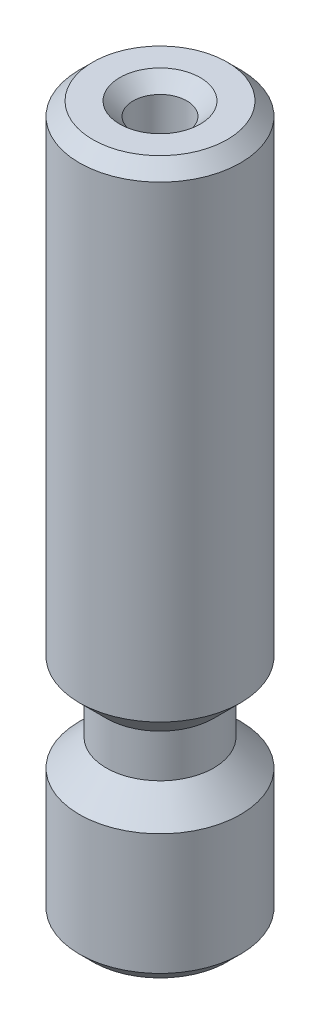
ISO-10303-21;
HEADER;
FILE_DESCRIPTION(('STEP AP214'),'2;1');
FILE_NAME('part.step','',(''),(''),'','','');
FILE_SCHEMA(('AUTOMOTIVE_DESIGN { 1 0 10303 214 1 1 1 1 }'));
ENDSEC;
DATA;
#1=APPLICATION_CONTEXT('core data for automotive mechanical design processes');
#2=APPLICATION_PROTOCOL_DEFINITION('international standard','automotive_design',2000,#1);
#3=PRODUCT_CONTEXT('',#1,'mechanical');
#4=PRODUCT('Part','Part','',(#3));
#5=PRODUCT_RELATED_PRODUCT_CATEGORY('part','',(#4));
#6=PRODUCT_DEFINITION_FORMATION('','',#4);
#7=PRODUCT_DEFINITION_CONTEXT('part definition',#1,'design');
#8=PRODUCT_DEFINITION('design','',#6,#7);
#9=PRODUCT_DEFINITION_SHAPE('','',#8);
#10=(LENGTH_UNIT() NAMED_UNIT(*) SI_UNIT(.MILLI.,.METRE.));
#11=(NAMED_UNIT(*) PLANE_ANGLE_UNIT() SI_UNIT($,.RADIAN.));
#12=(NAMED_UNIT(*) SI_UNIT($,.STERADIAN.) SOLID_ANGLE_UNIT());
#13=UNCERTAINTY_MEASURE_WITH_UNIT(LENGTH_MEASURE(1.E-05),#10,'distance_accuracy_value','');
#14=(GEOMETRIC_REPRESENTATION_CONTEXT(3) GLOBAL_UNCERTAINTY_ASSIGNED_CONTEXT((#13)) GLOBAL_UNIT_ASSIGNED_CONTEXT((#10,
#11,#12)) REPRESENTATION_CONTEXT('',''));
#15=CARTESIAN_POINT('',(0.,0.,0.));
#16=DIRECTION('',(0.,0.,1.));
#17=DIRECTION('',(1.,0.,0.));
#18=AXIS2_PLACEMENT_3D('',#15,#16,#17);
#19=CARTESIAN_POINT('',(-3.,0.,0.));
#20=DIRECTION('',(0.,1.,0.));
#21=DIRECTION('',(-1.,0.,0.));
#22=AXIS2_PLACEMENT_3D('',#19,#20,#21);
#23=PLANE('',#22);
#24=CARTESIAN_POINT('',(0.,0.,0.));
#25=DIRECTION('',(0.,1.,0.));
#26=DIRECTION('',(-1.,0.,0.));
#27=AXIS2_PLACEMENT_3D('',#24,#25,#26);
#28=CIRCLE('',#27,2.49999999999996);
#29=CARTESIAN_POINT('',(-2.49999999999996,0.,0.));
#30=VERTEX_POINT('',#29);
#31=EDGE_CURVE('E56',#30,#30,#28,.F.);
#32=ORIENTED_EDGE('',*,*,#31,.T.);
#33=EDGE_LOOP('',(#32));
#34=FACE_BOUND('',#33,.T.);
#35=CARTESIAN_POINT('',(0.,0.,0.));
#36=DIRECTION('',(0.,-1.,0.));
#37=DIRECTION('',(1.,0.,0.));
#38=AXIS2_PLACEMENT_3D('',#35,#36,#37);
#39=CIRCLE('',#38,1.);
#40=CARTESIAN_POINT('',(1.,0.,0.));
#41=VERTEX_POINT('',#40);
#42=EDGE_CURVE('E59',#41,#41,#39,.T.);
#43=ORIENTED_EDGE('',*,*,#42,.F.);
#44=EDGE_LOOP('',(#43));
#45=FACE_BOUND('',#44,.T.);
#46=ADVANCED_FACE('F33',(#34,#45),#23,.F.);
#47=CARTESIAN_POINT('',(3.49148133884313E-12,-1000.,0.));
#48=DIRECTION('',(0.,-1.,0.));
#49=DIRECTION('',(1.,0.,0.));
#50=AXIS2_PLACEMENT_3D('',#47,#48,#49);
#51=CYLINDRICAL_SURFACE('',#50,0.999999999961);
#52=CARTESIAN_POINT('',(0.,26.0000000000389,0.));
#53=DIRECTION('',(0.,-1.,0.));
#54=DIRECTION('',(1.,0.,0.));
#55=AXIS2_PLACEMENT_3D('',#52,#53,#54);
#56=CIRCLE('',#55,0.999999999961);
#57=CARTESIAN_POINT('',(0.999999999960909,26.0000000000389,0.));
#58=VERTEX_POINT('',#57);
#59=EDGE_CURVE('E10',#58,#58,#56,.F.);
#60=ORIENTED_EDGE('',*,*,#59,.T.);
#61=EDGE_LOOP('',(#60));
#62=FACE_BOUND('',#61,.T.);
#63=ORIENTED_EDGE('',*,*,#42,.T.);
#64=EDGE_LOOP('',(#63));
#65=FACE_BOUND('',#64,.T.);
#66=ADVANCED_FACE('F103',(#62,#65),#51,.F.);
#67=CARTESIAN_POINT('',(-0.999999999922091,26.5,0.));
#68=DIRECTION('',(0.,-1.,0.));
#69=DIRECTION('',(1.,0.,0.));
#70=AXIS2_PLACEMENT_3D('',#67,#68,#69);
#71=PLANE('',#70);
#72=CARTESIAN_POINT('',(0.,26.5,0.));
#73=DIRECTION('',(0.,-1.,0.));
#74=DIRECTION('',(1.,0.,0.));
#75=AXIS2_PLACEMENT_3D('',#72,#73,#74);
#76=CIRCLE('',#75,2.49999999992367);
#77=CARTESIAN_POINT('',(2.49999999992358,26.5,0.));
#78=VERTEX_POINT('',#77);
#79=EDGE_CURVE('E40',#78,#78,#76,.F.);
#80=ORIENTED_EDGE('',*,*,#79,.T.);
#81=EDGE_LOOP('',(#80));
#82=FACE_BOUND('',#81,.T.);
#83=CARTESIAN_POINT('',(0.,26.5,0.));
#84=DIRECTION('',(0.,-1.,0.));
#85=DIRECTION('',(1.,0.,0.));
#86=AXIS2_PLACEMENT_3D('',#83,#84,#85);
#87=CIRCLE('',#86,1.4999999999221);
#88=CARTESIAN_POINT('',(1.499999999922,26.5,0.));
#89=VERTEX_POINT('',#88);
#90=EDGE_CURVE('E44',#89,#89,#87,.T.);
#91=ORIENTED_EDGE('',*,*,#90,.T.);
#92=EDGE_LOOP('',(#91));
#93=FACE_BOUND('',#92,.T.);
#94=ADVANCED_FACE('F97',(#82,#93),#71,.F.);
#95=CARTESIAN_POINT('',(3.49148133884313E-12,-1000.,0.));
#96=DIRECTION('',(0.,-1.,0.));
#97=DIRECTION('',(1.,0.,0.));
#98=AXIS2_PLACEMENT_3D('',#95,#96,#97);
#99=CYLINDRICAL_SURFACE('',#98,2.99999999992388);
#100=CARTESIAN_POINT('',(0.,25.9999999999998,0.));
#101=DIRECTION('',(0.,-1.,0.));
#102=DIRECTION('',(1.,0.,0.));
#103=AXIS2_PLACEMENT_3D('',#100,#101,#102);
#104=CIRCLE('',#103,2.99999999992388);
#105=CARTESIAN_POINT('',(2.99999999992379,25.9999999999998,0.));
#106=VERTEX_POINT('',#105);
#107=EDGE_CURVE('E48',#106,#106,#104,.T.);
#108=ORIENTED_EDGE('',*,*,#107,.T.);
#109=EDGE_LOOP('',(#108));
#110=FACE_BOUND('',#109,.T.);
#111=CARTESIAN_POINT('',(0.,8.59999999999994,0.));
#112=DIRECTION('',(0.,-1.,0.));
#113=DIRECTION('',(1.,0.,0.));
#114=AXIS2_PLACEMENT_3D('',#111,#112,#113);
#115=CIRCLE('',#114,2.99999999992391);
#116=CARTESIAN_POINT('',(2.99999999992388,8.59999999999995,0.));
#117=VERTEX_POINT('',#116);
#118=EDGE_CURVE('E62',#117,#117,#115,.T.);
#119=ORIENTED_EDGE('',*,*,#118,.F.);
#120=EDGE_LOOP('',(#119));
#121=FACE_BOUND('',#120,.T.);
#122=ADVANCED_FACE('F92',(#110,#121),#99,.T.);
#123=CARTESIAN_POINT('',(0.,8.59999999999994,0.));
#124=DIRECTION('',(0.,1.,0.));
#125=DIRECTION('',(-1.,0.,0.));
#126=AXIS2_PLACEMENT_3D('',#123,#124,#125);
#127=CONICAL_SURFACE('',#126,2.99999999992391,0.785398163397426);
#128=CARTESIAN_POINT('',(0.,7.59999999999805,0.));
#129=DIRECTION('',(0.,-1.,0.));
#130=DIRECTION('',(1.,0.,0.));
#131=AXIS2_PLACEMENT_3D('',#128,#129,#130);
#132=CIRCLE('',#131,1.99999999992207);
#133=CARTESIAN_POINT('',(1.99999999992204,7.59999999999806,0.));
#134=VERTEX_POINT('',#133);
#135=EDGE_CURVE('E65',#134,#134,#132,.T.);
#136=ORIENTED_EDGE('',*,*,#135,.F.);
#137=EDGE_LOOP('',(#136));
#138=FACE_BOUND('',#137,.T.);
#139=ORIENTED_EDGE('',*,*,#118,.T.);
#140=EDGE_LOOP('',(#139));
#141=FACE_BOUND('',#140,.T.);
#142=ADVANCED_FACE('F86',(#138,#141),#127,.T.);
#143=CARTESIAN_POINT('',(3.49148133884313E-12,-1000.,0.));
#144=DIRECTION('',(0.,-1.,0.));
#145=DIRECTION('',(1.,0.,0.));
#146=AXIS2_PLACEMENT_3D('',#143,#144,#145);
#147=CYLINDRICAL_SURFACE('',#146,1.99999999996102);
#148=CARTESIAN_POINT('',(0.,6.00000000000001,0.));
#149=DIRECTION('',(0.,-1.,0.));
#150=DIRECTION('',(1.,0.,0.));
#151=AXIS2_PLACEMENT_3D('',#148,#149,#150);
#152=CIRCLE('',#151,1.99999999999998);
#153=CARTESIAN_POINT('',(1.99999999999996,6.00000000000001,0.));
#154=VERTEX_POINT('',#153);
#155=EDGE_CURVE('E68',#154,#154,#152,.T.);
#156=ORIENTED_EDGE('',*,*,#155,.F.);
#157=EDGE_LOOP('',(#156));
#158=FACE_BOUND('',#157,.T.);
#159=ORIENTED_EDGE('',*,*,#135,.T.);
#160=EDGE_LOOP('',(#159));
#161=FACE_BOUND('',#160,.T.);
#162=ADVANCED_FACE('F80',(#158,#161),#147,.T.);
#163=CARTESIAN_POINT('',(0.,6.00000000000001,0.));
#164=DIRECTION('',(0.,-1.,0.));
#165=DIRECTION('',(1.,0.,0.));
#166=AXIS2_PLACEMENT_3D('',#163,#164,#165);
#167=CONICAL_SURFACE('',#166,1.99999999999998,0.785398163397393);
#168=CARTESIAN_POINT('',(0.,4.99999999999989,0.));
#169=DIRECTION('',(0.,-1.,0.));
#170=DIRECTION('',(1.,0.,0.));
#171=AXIS2_PLACEMENT_3D('',#168,#169,#170);
#172=CIRCLE('',#171,2.99999999999998);
#173=CARTESIAN_POINT('',(2.99999999999997,4.9999999999999,0.));
#174=VERTEX_POINT('',#173);
#175=EDGE_CURVE('E71',#174,#174,#172,.T.);
#176=ORIENTED_EDGE('',*,*,#175,.F.);
#177=EDGE_LOOP('',(#176));
#178=FACE_BOUND('',#177,.T.);
#179=ORIENTED_EDGE('',*,*,#155,.T.);
#180=EDGE_LOOP('',(#179));
#181=FACE_BOUND('',#180,.T.);
#182=ADVANCED_FACE('F77',(#178,#181),#167,.T.);
#183=CARTESIAN_POINT('',(3.49148133884313E-12,-1000.,0.));
#184=DIRECTION('',(0.,-1.,0.));
#185=DIRECTION('',(1.,0.,0.));
#186=AXIS2_PLACEMENT_3D('',#183,#184,#185);
#187=CYLINDRICAL_SURFACE('',#186,2.99999999999999);
#188=CARTESIAN_POINT('',(0.,0.499999999999945,0.));
#189=DIRECTION('',(0.,1.,0.));
#190=DIRECTION('',(-1.,0.,0.));
#191=AXIS2_PLACEMENT_3D('',#188,#189,#190);
#192=CIRCLE('',#191,2.99999999999999);
#193=CARTESIAN_POINT('',(-2.99999999999999,0.499999999999934,0.));
#194=VERTEX_POINT('',#193);
#195=EDGE_CURVE('E53',#194,#194,#192,.T.);
#196=ORIENTED_EDGE('',*,*,#195,.T.);
#197=EDGE_LOOP('',(#196));
#198=FACE_BOUND('',#197,.T.);
#199=ORIENTED_EDGE('',*,*,#175,.T.);
#200=EDGE_LOOP('',(#199));
#201=FACE_BOUND('',#200,.T.);
#202=ADVANCED_FACE('F75',(#198,#201),#187,.T.);
#203=CARTESIAN_POINT('',(0.,0.,0.));
#204=DIRECTION('',(0.,1.,0.));
#205=DIRECTION('',(-1.,0.,0.));
#206=AXIS2_PLACEMENT_3D('',#203,#204,#205);
#207=CONICAL_SURFACE('',#206,2.49999999999996,0.785398163397539);
#208=ORIENTED_EDGE('',*,*,#195,.F.);
#209=EDGE_LOOP('',(#208));
#210=FACE_BOUND('',#209,.T.);
#211=ORIENTED_EDGE('',*,*,#31,.F.);
#212=EDGE_LOOP('',(#211));
#213=FACE_BOUND('',#212,.T.);
#214=ADVANCED_FACE('F114',(#210,#213),#207,.T.);
#215=CARTESIAN_POINT('',(0.,25.9999999999998,0.));
#216=DIRECTION('',(0.,-1.,0.));
#217=DIRECTION('',(1.,0.,0.));
#218=AXIS2_PLACEMENT_3D('',#215,#216,#217);
#219=CONICAL_SURFACE('',#218,2.99999999992388,0.785398163397453);
#220=ORIENTED_EDGE('',*,*,#79,.F.);
#221=EDGE_LOOP('',(#220));
#222=FACE_BOUND('',#221,.T.);
#223=ORIENTED_EDGE('',*,*,#107,.F.);
#224=EDGE_LOOP('',(#223));
#225=FACE_BOUND('',#224,.T.);
#226=ADVANCED_FACE('F116',(#222,#225),#219,.T.);
#227=CARTESIAN_POINT('',(0.,26.5,0.));
#228=DIRECTION('',(0.,1.,0.));
#229=DIRECTION('',(-1.,0.,0.));
#230=AXIS2_PLACEMENT_3D('',#227,#228,#229);
#231=CONICAL_SURFACE('',#230,1.49999999992206,0.78539816339742);
#232=ORIENTED_EDGE('',*,*,#59,.F.);
#233=EDGE_LOOP('',(#232));
#234=FACE_BOUND('',#233,.T.);
#235=ORIENTED_EDGE('',*,*,#90,.F.);
#236=EDGE_LOOP('',(#235));
#237=FACE_BOUND('',#236,.T.);
#238=ADVANCED_FACE('F35',(#234,#237),#231,.F.);
#239=CLOSED_SHELL('',(#46,#66,#94,#122,#142,#162,#182,#202,#214,#226,#238));
#240=MANIFOLD_SOLID_BREP('B2',#239);
#241=ADVANCED_BREP_SHAPE_REPRESENTATION('',(#18,#240),#14);
#242=SHAPE_DEFINITION_REPRESENTATION(#9,#241);
ENDSEC;
END-ISO-10303-21;
